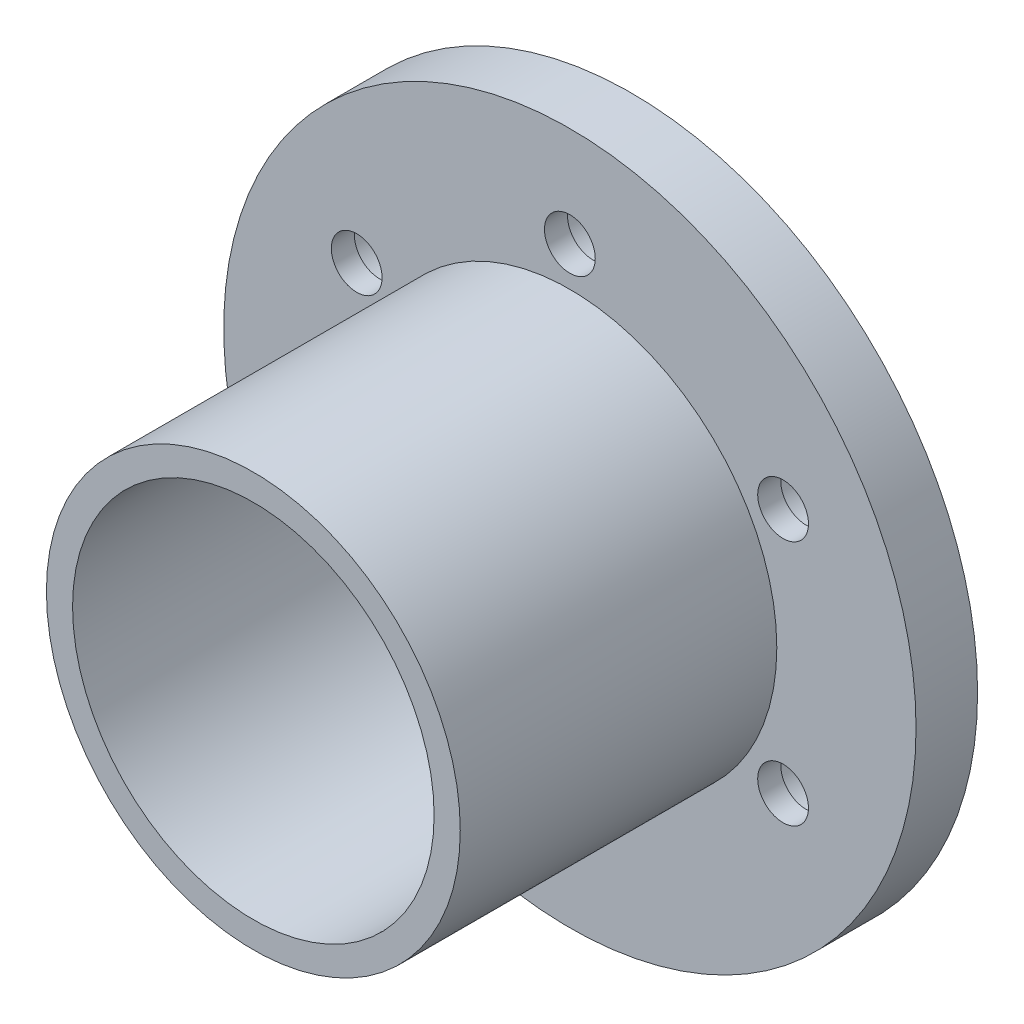
ISO-10303-21;
HEADER;
FILE_DESCRIPTION(('STEP AP214'),'2;1');
FILE_NAME('part.step','',(''),(''),'','','');
FILE_SCHEMA(('AUTOMOTIVE_DESIGN { 1 0 10303 214 1 1 1 1 }'));
ENDSEC;
DATA;
#1=APPLICATION_CONTEXT('core data for automotive mechanical design processes');
#2=APPLICATION_PROTOCOL_DEFINITION('international standard','automotive_design',2000,#1);
#3=PRODUCT_CONTEXT('',#1,'mechanical');
#4=PRODUCT('Part','Part','',(#3));
#5=PRODUCT_RELATED_PRODUCT_CATEGORY('part','',(#4));
#6=PRODUCT_DEFINITION_FORMATION('','',#4);
#7=PRODUCT_DEFINITION_CONTEXT('part definition',#1,'design');
#8=PRODUCT_DEFINITION('design','',#6,#7);
#9=PRODUCT_DEFINITION_SHAPE('','',#8);
#10=(LENGTH_UNIT() NAMED_UNIT(*) SI_UNIT(.MILLI.,.METRE.));
#11=(NAMED_UNIT(*) PLANE_ANGLE_UNIT() SI_UNIT($,.RADIAN.));
#12=(NAMED_UNIT(*) SI_UNIT($,.STERADIAN.) SOLID_ANGLE_UNIT());
#13=UNCERTAINTY_MEASURE_WITH_UNIT(LENGTH_MEASURE(1.E-05),#10,'distance_accuracy_value','');
#14=(GEOMETRIC_REPRESENTATION_CONTEXT(3) GLOBAL_UNCERTAINTY_ASSIGNED_CONTEXT((#13)) GLOBAL_UNIT_ASSIGNED_CONTEXT((#10,
#11,#12)) REPRESENTATION_CONTEXT('',''));
#15=CARTESIAN_POINT('',(0.,0.,0.));
#16=DIRECTION('',(0.,0.,1.));
#17=DIRECTION('',(1.,0.,0.));
#18=AXIS2_PLACEMENT_3D('',#15,#16,#17);
#19=CARTESIAN_POINT('',(0.,0.,8.));
#20=DIRECTION('',(0.,0.,-1.));
#21=DIRECTION('',(-1.,0.,0.));
#22=AXIS2_PLACEMENT_3D('',#19,#20,#21);
#23=CYLINDRICAL_SURFACE('',#22,45.);
#24=CARTESIAN_POINT('',(0.,0.,8.));
#25=DIRECTION('',(0.,0.,1.));
#26=DIRECTION('',(1.,0.,0.));
#27=AXIS2_PLACEMENT_3D('',#24,#25,#26);
#28=CIRCLE('',#27,45.);
#29=CARTESIAN_POINT('',(45.,0.,8.));
#30=VERTEX_POINT('',#29);
#31=EDGE_CURVE('E10',#30,#30,#28,.T.);
#32=ORIENTED_EDGE('',*,*,#31,.F.);
#33=EDGE_LOOP('',(#32));
#34=FACE_BOUND('',#33,.T.);
#35=CARTESIAN_POINT('',(0.,0.,0.));
#36=DIRECTION('',(0.,0.,1.));
#37=DIRECTION('',(1.,0.,0.));
#38=AXIS2_PLACEMENT_3D('',#35,#36,#37);
#39=CIRCLE('',#38,45.);
#40=CARTESIAN_POINT('',(45.,0.,0.));
#41=VERTEX_POINT('',#40);
#42=EDGE_CURVE('E39',#41,#41,#39,.T.);
#43=ORIENTED_EDGE('',*,*,#42,.T.);
#44=EDGE_LOOP('',(#43));
#45=FACE_BOUND('',#44,.T.);
#46=ADVANCED_FACE('F32',(#34,#45),#23,.T.);
#47=CARTESIAN_POINT('',(0.,0.,8.));
#48=DIRECTION('',(0.,0.,1.));
#49=DIRECTION('',(1.,0.,0.));
#50=AXIS2_PLACEMENT_3D('',#47,#48,#49);
#51=PLANE('',#50);
#52=CARTESIAN_POINT('',(27.7128129211019,16.0000000000003,8.));
#53=DIRECTION('',(0.,0.,1.));
#54=DIRECTION('',(1.,0.,0.));
#55=AXIS2_PLACEMENT_3D('',#52,#53,#54);
#56=CIRCLE('',#55,3.3);
#57=CARTESIAN_POINT('',(31.0128129211018,16.0000000000003,8.));
#58=VERTEX_POINT('',#57);
#59=EDGE_CURVE('E35',#58,#58,#56,.T.);
#60=ORIENTED_EDGE('',*,*,#59,.F.);
#61=EDGE_LOOP('',(#60));
#62=FACE_BOUND('',#61,.T.);
#63=CARTESIAN_POINT('',(27.7128129211022,-15.9999999999997,8.));
#64=DIRECTION('',(0.,0.,1.));
#65=DIRECTION('',(1.,0.,0.));
#66=AXIS2_PLACEMENT_3D('',#63,#64,#65);
#67=CIRCLE('',#66,3.3);
#68=CARTESIAN_POINT('',(31.0128129211022,-15.9999999999997,8.));
#69=VERTEX_POINT('',#68);
#70=EDGE_CURVE('E68',#69,#69,#67,.T.);
#71=ORIENTED_EDGE('',*,*,#70,.F.);
#72=EDGE_LOOP('',(#71));
#73=FACE_BOUND('',#72,.T.);
#74=CARTESIAN_POINT('',(0.,-32.,8.));
#75=DIRECTION('',(0.,0.,1.));
#76=DIRECTION('',(1.,0.,0.));
#77=AXIS2_PLACEMENT_3D('',#74,#75,#76);
#78=CIRCLE('',#77,3.3);
#79=CARTESIAN_POINT('',(3.3,-32.,8.));
#80=VERTEX_POINT('',#79);
#81=EDGE_CURVE('E64',#80,#80,#78,.T.);
#82=ORIENTED_EDGE('',*,*,#81,.F.);
#83=EDGE_LOOP('',(#82));
#84=FACE_BOUND('',#83,.T.);
#85=CARTESIAN_POINT('',(-27.712812921102,-16.0000000000001,8.));
#86=DIRECTION('',(0.,0.,1.));
#87=DIRECTION('',(1.,0.,0.));
#88=AXIS2_PLACEMENT_3D('',#85,#86,#87);
#89=CIRCLE('',#88,3.3);
#90=CARTESIAN_POINT('',(-24.412812921102,-16.0000000000001,8.));
#91=VERTEX_POINT('',#90);
#92=EDGE_CURVE('E59',#91,#91,#89,.T.);
#93=ORIENTED_EDGE('',*,*,#92,.F.);
#94=EDGE_LOOP('',(#93));
#95=FACE_BOUND('',#94,.T.);
#96=CARTESIAN_POINT('',(-27.7128129211021,15.9999999999999,8.));
#97=DIRECTION('',(0.,0.,1.));
#98=DIRECTION('',(1.,0.,0.));
#99=AXIS2_PLACEMENT_3D('',#96,#97,#98);
#100=CIRCLE('',#99,3.3);
#101=CARTESIAN_POINT('',(-24.4128129211021,15.9999999999999,8.));
#102=VERTEX_POINT('',#101);
#103=EDGE_CURVE('E54',#102,#102,#100,.T.);
#104=ORIENTED_EDGE('',*,*,#103,.F.);
#105=EDGE_LOOP('',(#104));
#106=FACE_BOUND('',#105,.T.);
#107=CARTESIAN_POINT('',(0.,32.,8.));
#108=DIRECTION('',(0.,0.,1.));
#109=DIRECTION('',(1.,0.,0.));
#110=AXIS2_PLACEMENT_3D('',#107,#108,#109);
#111=CIRCLE('',#110,3.3);
#112=CARTESIAN_POINT('',(3.3,32.,8.));
#113=VERTEX_POINT('',#112);
#114=EDGE_CURVE('E49',#113,#113,#111,.T.);
#115=ORIENTED_EDGE('',*,*,#114,.F.);
#116=EDGE_LOOP('',(#115));
#117=FACE_BOUND('',#116,.T.);
#118=CARTESIAN_POINT('',(0.,0.,8.));
#119=DIRECTION('',(0.,0.,1.));
#120=DIRECTION('',(1.,0.,0.));
#121=AXIS2_PLACEMENT_3D('',#118,#119,#120);
#122=CIRCLE('',#121,26.9);
#123=CARTESIAN_POINT('',(26.9,0.,8.));
#124=VERTEX_POINT('',#123);
#125=EDGE_CURVE('E114',#124,#124,#122,.T.);
#126=ORIENTED_EDGE('',*,*,#125,.F.);
#127=EDGE_LOOP('',(#126));
#128=FACE_BOUND('',#127,.T.);
#129=ORIENTED_EDGE('',*,*,#31,.T.);
#130=EDGE_LOOP('',(#129));
#131=FACE_BOUND('',#130,.T.);
#132=ADVANCED_FACE('F122',(#62,#73,#84,#95,#106,#117,#128,#131),#51,.T.);
#133=CARTESIAN_POINT('',(0.,0.,0.));
#134=DIRECTION('',(0.,0.,1.));
#135=DIRECTION('',(1.,0.,0.));
#136=AXIS2_PLACEMENT_3D('',#133,#134,#135);
#137=PLANE('',#136);
#138=CARTESIAN_POINT('',(27.7128129211019,16.0000000000003,0.));
#139=DIRECTION('',(0.,0.,-1.));
#140=DIRECTION('',(-1.,0.,0.));
#141=AXIS2_PLACEMENT_3D('',#138,#139,#140);
#142=CIRCLE('',#141,5.);
#143=CARTESIAN_POINT('',(22.7128129211018,16.0000000000003,0.));
#144=VERTEX_POINT('',#143);
#145=EDGE_CURVE('E225',#144,#144,#142,.T.);
#146=ORIENTED_EDGE('',*,*,#145,.F.);
#147=EDGE_LOOP('',(#146));
#148=FACE_BOUND('',#147,.T.);
#149=CARTESIAN_POINT('',(27.7128129211022,-15.9999999999997,0.));
#150=DIRECTION('',(0.,0.,-1.));
#151=DIRECTION('',(-1.,0.,0.));
#152=AXIS2_PLACEMENT_3D('',#149,#150,#151);
#153=CIRCLE('',#152,5.);
#154=CARTESIAN_POINT('',(22.7128129211022,-15.9999999999997,0.));
#155=VERTEX_POINT('',#154);
#156=EDGE_CURVE('E83',#155,#155,#153,.T.);
#157=ORIENTED_EDGE('',*,*,#156,.F.);
#158=EDGE_LOOP('',(#157));
#159=FACE_BOUND('',#158,.T.);
#160=CARTESIAN_POINT('',(0.,-32.,0.));
#161=DIRECTION('',(0.,0.,-1.));
#162=DIRECTION('',(-1.,0.,0.));
#163=AXIS2_PLACEMENT_3D('',#160,#161,#162);
#164=CIRCLE('',#163,5.);
#165=CARTESIAN_POINT('',(-5.,-32.,0.));
#166=VERTEX_POINT('',#165);
#167=EDGE_CURVE('E70',#166,#166,#164,.T.);
#168=ORIENTED_EDGE('',*,*,#167,.F.);
#169=EDGE_LOOP('',(#168));
#170=FACE_BOUND('',#169,.T.);
#171=CARTESIAN_POINT('',(-27.712812921102,-16.0000000000001,0.));
#172=DIRECTION('',(0.,0.,-1.));
#173=DIRECTION('',(-1.,0.,0.));
#174=AXIS2_PLACEMENT_3D('',#171,#172,#173);
#175=CIRCLE('',#174,5.);
#176=CARTESIAN_POINT('',(-32.712812921102,-16.0000000000001,0.));
#177=VERTEX_POINT('',#176);
#178=EDGE_CURVE('E66',#177,#177,#175,.T.);
#179=ORIENTED_EDGE('',*,*,#178,.F.);
#180=EDGE_LOOP('',(#179));
#181=FACE_BOUND('',#180,.T.);
#182=CARTESIAN_POINT('',(-27.7128129211021,15.9999999999999,0.));
#183=DIRECTION('',(0.,0.,-1.));
#184=DIRECTION('',(-1.,0.,0.));
#185=AXIS2_PLACEMENT_3D('',#182,#183,#184);
#186=CIRCLE('',#185,5.);
#187=CARTESIAN_POINT('',(-32.7128129211021,15.9999999999999,0.));
#188=VERTEX_POINT('',#187);
#189=EDGE_CURVE('E62',#188,#188,#186,.T.);
#190=ORIENTED_EDGE('',*,*,#189,.F.);
#191=EDGE_LOOP('',(#190));
#192=FACE_BOUND('',#191,.T.);
#193=CARTESIAN_POINT('',(0.,32.,0.));
#194=DIRECTION('',(0.,0.,-1.));
#195=DIRECTION('',(-1.,0.,0.));
#196=AXIS2_PLACEMENT_3D('',#193,#194,#195);
#197=CIRCLE('',#196,5.);
#198=CARTESIAN_POINT('',(-5.,32.,0.));
#199=VERTEX_POINT('',#198);
#200=EDGE_CURVE('E57',#199,#199,#197,.T.);
#201=ORIENTED_EDGE('',*,*,#200,.F.);
#202=EDGE_LOOP('',(#201));
#203=FACE_BOUND('',#202,.T.);
#204=CARTESIAN_POINT('',(0.,0.,0.));
#205=DIRECTION('',(0.,0.,1.));
#206=DIRECTION('',(1.,0.,0.));
#207=AXIS2_PLACEMENT_3D('',#204,#205,#206);
#208=CIRCLE('',#207,23.5);
#209=CARTESIAN_POINT('',(23.5,0.,0.));
#210=VERTEX_POINT('',#209);
#211=EDGE_CURVE('E44',#210,#210,#208,.T.);
#212=ORIENTED_EDGE('',*,*,#211,.T.);
#213=EDGE_LOOP('',(#212));
#214=FACE_BOUND('',#213,.T.);
#215=ORIENTED_EDGE('',*,*,#42,.F.);
#216=EDGE_LOOP('',(#215));
#217=FACE_BOUND('',#216,.T.);
#218=ADVANCED_FACE('F124',(#148,#159,#170,#181,#192,#203,#214,#217),#137,.F.);
#219=CARTESIAN_POINT('',(0.,0.,0.));
#220=DIRECTION('',(0.,0.,1.));
#221=DIRECTION('',(1.,0.,0.));
#222=AXIS2_PLACEMENT_3D('',#219,#220,#221);
#223=CYLINDRICAL_SURFACE('',#222,23.5);
#224=ORIENTED_EDGE('',*,*,#211,.F.);
#225=EDGE_LOOP('',(#224));
#226=FACE_BOUND('',#225,.T.);
#227=CARTESIAN_POINT('',(0.,0.,49.148));
#228=DIRECTION('',(0.,0.,1.));
#229=DIRECTION('',(1.,0.,0.));
#230=AXIS2_PLACEMENT_3D('',#227,#228,#229);
#231=CIRCLE('',#230,23.5);
#232=CARTESIAN_POINT('',(23.5,0.,49.148));
#233=VERTEX_POINT('',#232);
#234=EDGE_CURVE('E52',#233,#233,#231,.T.);
#235=ORIENTED_EDGE('',*,*,#234,.T.);
#236=EDGE_LOOP('',(#235));
#237=FACE_BOUND('',#236,.T.);
#238=ADVANCED_FACE('F131',(#226,#237),#223,.F.);
#239=CARTESIAN_POINT('',(0.,0.,49.148));
#240=DIRECTION('',(0.,0.,-1.));
#241=DIRECTION('',(-1.,0.,0.));
#242=AXIS2_PLACEMENT_3D('',#239,#240,#241);
#243=CYLINDRICAL_SURFACE('',#242,26.9);
#244=CARTESIAN_POINT('',(0.,0.,49.148));
#245=DIRECTION('',(0.,0.,1.));
#246=DIRECTION('',(1.,0.,0.));
#247=AXIS2_PLACEMENT_3D('',#244,#245,#246);
#248=CIRCLE('',#247,26.9);
#249=CARTESIAN_POINT('',(26.9,0.,49.148));
#250=VERTEX_POINT('',#249);
#251=EDGE_CURVE('E115',#250,#250,#248,.T.);
#252=ORIENTED_EDGE('',*,*,#251,.F.);
#253=EDGE_LOOP('',(#252));
#254=FACE_BOUND('',#253,.T.);
#255=ORIENTED_EDGE('',*,*,#125,.T.);
#256=EDGE_LOOP('',(#255));
#257=FACE_BOUND('',#256,.T.);
#258=ADVANCED_FACE('F120',(#254,#257),#243,.T.);
#259=CARTESIAN_POINT('',(0.,0.,49.148));
#260=DIRECTION('',(0.,0.,1.));
#261=DIRECTION('',(1.,0.,0.));
#262=AXIS2_PLACEMENT_3D('',#259,#260,#261);
#263=PLANE('',#262);
#264=ORIENTED_EDGE('',*,*,#234,.F.);
#265=EDGE_LOOP('',(#264));
#266=FACE_BOUND('',#265,.T.);
#267=ORIENTED_EDGE('',*,*,#251,.T.);
#268=EDGE_LOOP('',(#267));
#269=FACE_BOUND('',#268,.T.);
#270=ADVANCED_FACE('F142',(#266,#269),#263,.T.);
#271=CARTESIAN_POINT('',(0.,32.,0.));
#272=DIRECTION('',(0.,0.,-1.));
#273=DIRECTION('',(-1.,0.,0.));
#274=AXIS2_PLACEMENT_3D('',#271,#272,#273);
#275=CYLINDRICAL_SURFACE('',#274,3.3);
#276=ORIENTED_EDGE('',*,*,#114,.T.);
#277=EDGE_LOOP('',(#276));
#278=FACE_BOUND('',#277,.T.);
#279=CARTESIAN_POINT('',(0.,32.,5.));
#280=DIRECTION('',(0.,0.,-1.));
#281=DIRECTION('',(-1.,0.,0.));
#282=AXIS2_PLACEMENT_3D('',#279,#280,#281);
#283=CIRCLE('',#282,3.3);
#284=CARTESIAN_POINT('',(-3.3,32.,5.));
#285=VERTEX_POINT('',#284);
#286=EDGE_CURVE('E53',#285,#285,#283,.T.);
#287=ORIENTED_EDGE('',*,*,#286,.T.);
#288=EDGE_LOOP('',(#287));
#289=FACE_BOUND('',#288,.T.);
#290=ADVANCED_FACE('F146',(#278,#289),#275,.F.);
#291=CARTESIAN_POINT('',(3.3,32.,5.));
#292=DIRECTION('',(0.,0.,1.));
#293=DIRECTION('',(1.,0.,0.));
#294=AXIS2_PLACEMENT_3D('',#291,#292,#293);
#295=PLANE('',#294);
#296=ORIENTED_EDGE('',*,*,#286,.F.);
#297=EDGE_LOOP('',(#296));
#298=FACE_BOUND('',#297,.T.);
#299=CARTESIAN_POINT('',(0.,32.,5.));
#300=DIRECTION('',(0.,0.,-1.));
#301=DIRECTION('',(-1.,0.,0.));
#302=AXIS2_PLACEMENT_3D('',#299,#300,#301);
#303=CIRCLE('',#302,5.);
#304=CARTESIAN_POINT('',(-5.,32.,5.));
#305=VERTEX_POINT('',#304);
#306=EDGE_CURVE('E107',#305,#305,#303,.T.);
#307=ORIENTED_EDGE('',*,*,#306,.T.);
#308=EDGE_LOOP('',(#307));
#309=FACE_BOUND('',#308,.T.);
#310=ADVANCED_FACE('F150',(#298,#309),#295,.F.);
#311=CARTESIAN_POINT('',(0.,32.,0.));
#312=DIRECTION('',(0.,0.,-1.));
#313=DIRECTION('',(-1.,0.,0.));
#314=AXIS2_PLACEMENT_3D('',#311,#312,#313);
#315=CYLINDRICAL_SURFACE('',#314,5.);
#316=ORIENTED_EDGE('',*,*,#306,.F.);
#317=EDGE_LOOP('',(#316));
#318=FACE_BOUND('',#317,.T.);
#319=ORIENTED_EDGE('',*,*,#200,.T.);
#320=EDGE_LOOP('',(#319));
#321=FACE_BOUND('',#320,.T.);
#322=ADVANCED_FACE('F154',(#318,#321),#315,.F.);
#323=CARTESIAN_POINT('',(-27.7128129211021,15.9999999999999,0.));
#324=DIRECTION('',(0.,0.,-1.));
#325=DIRECTION('',(-1.,0.,0.));
#326=AXIS2_PLACEMENT_3D('',#323,#324,#325);
#327=CYLINDRICAL_SURFACE('',#326,3.3);
#328=ORIENTED_EDGE('',*,*,#103,.T.);
#329=EDGE_LOOP('',(#328));
#330=FACE_BOUND('',#329,.T.);
#331=CARTESIAN_POINT('',(-27.7128129211021,15.9999999999999,5.));
#332=DIRECTION('',(0.,0.,-1.));
#333=DIRECTION('',(-1.,0.,0.));
#334=AXIS2_PLACEMENT_3D('',#331,#332,#333);
#335=CIRCLE('',#334,3.3);
#336=CARTESIAN_POINT('',(-31.0128129211021,15.9999999999999,5.));
#337=VERTEX_POINT('',#336);
#338=EDGE_CURVE('E58',#337,#337,#335,.T.);
#339=ORIENTED_EDGE('',*,*,#338,.T.);
#340=EDGE_LOOP('',(#339));
#341=FACE_BOUND('',#340,.T.);
#342=ADVANCED_FACE('F158',(#330,#341),#327,.F.);
#343=CARTESIAN_POINT('',(-24.4128129211021,15.9999999999999,5.));
#344=DIRECTION('',(0.,0.,1.));
#345=DIRECTION('',(1.,0.,0.));
#346=AXIS2_PLACEMENT_3D('',#343,#344,#345);
#347=PLANE('',#346);
#348=ORIENTED_EDGE('',*,*,#338,.F.);
#349=EDGE_LOOP('',(#348));
#350=FACE_BOUND('',#349,.T.);
#351=CARTESIAN_POINT('',(-27.7128129211021,15.9999999999999,5.));
#352=DIRECTION('',(0.,0.,-1.));
#353=DIRECTION('',(-1.,0.,0.));
#354=AXIS2_PLACEMENT_3D('',#351,#352,#353);
#355=CIRCLE('',#354,5.);
#356=CARTESIAN_POINT('',(-32.7128129211021,15.9999999999999,5.));
#357=VERTEX_POINT('',#356);
#358=EDGE_CURVE('E100',#357,#357,#355,.T.);
#359=ORIENTED_EDGE('',*,*,#358,.T.);
#360=EDGE_LOOP('',(#359));
#361=FACE_BOUND('',#360,.T.);
#362=ADVANCED_FACE('F162',(#350,#361),#347,.F.);
#363=CARTESIAN_POINT('',(-27.7128129211021,15.9999999999999,0.));
#364=DIRECTION('',(0.,0.,-1.));
#365=DIRECTION('',(-1.,0.,0.));
#366=AXIS2_PLACEMENT_3D('',#363,#364,#365);
#367=CYLINDRICAL_SURFACE('',#366,5.);
#368=ORIENTED_EDGE('',*,*,#358,.F.);
#369=EDGE_LOOP('',(#368));
#370=FACE_BOUND('',#369,.T.);
#371=ORIENTED_EDGE('',*,*,#189,.T.);
#372=EDGE_LOOP('',(#371));
#373=FACE_BOUND('',#372,.T.);
#374=ADVANCED_FACE('F166',(#370,#373),#367,.F.);
#375=CARTESIAN_POINT('',(-27.712812921102,-16.0000000000001,0.));
#376=DIRECTION('',(0.,0.,-1.));
#377=DIRECTION('',(-1.,0.,0.));
#378=AXIS2_PLACEMENT_3D('',#375,#376,#377);
#379=CYLINDRICAL_SURFACE('',#378,3.3);
#380=ORIENTED_EDGE('',*,*,#92,.T.);
#381=EDGE_LOOP('',(#380));
#382=FACE_BOUND('',#381,.T.);
#383=CARTESIAN_POINT('',(-27.712812921102,-16.0000000000001,5.));
#384=DIRECTION('',(0.,0.,-1.));
#385=DIRECTION('',(-1.,0.,0.));
#386=AXIS2_PLACEMENT_3D('',#383,#384,#385);
#387=CIRCLE('',#386,3.3);
#388=CARTESIAN_POINT('',(-31.012812921102,-16.0000000000001,5.));
#389=VERTEX_POINT('',#388);
#390=EDGE_CURVE('E63',#389,#389,#387,.T.);
#391=ORIENTED_EDGE('',*,*,#390,.T.);
#392=EDGE_LOOP('',(#391));
#393=FACE_BOUND('',#392,.T.);
#394=ADVANCED_FACE('F170',(#382,#393),#379,.F.);
#395=CARTESIAN_POINT('',(-24.412812921102,-16.0000000000001,5.));
#396=DIRECTION('',(0.,0.,1.));
#397=DIRECTION('',(1.,0.,0.));
#398=AXIS2_PLACEMENT_3D('',#395,#396,#397);
#399=PLANE('',#398);
#400=ORIENTED_EDGE('',*,*,#390,.F.);
#401=EDGE_LOOP('',(#400));
#402=FACE_BOUND('',#401,.T.);
#403=CARTESIAN_POINT('',(-27.712812921102,-16.0000000000001,5.));
#404=DIRECTION('',(0.,0.,-1.));
#405=DIRECTION('',(-1.,0.,0.));
#406=AXIS2_PLACEMENT_3D('',#403,#404,#405);
#407=CIRCLE('',#406,5.);
#408=CARTESIAN_POINT('',(-32.712812921102,-16.0000000000001,5.));
#409=VERTEX_POINT('',#408);
#410=EDGE_CURVE('E93',#409,#409,#407,.T.);
#411=ORIENTED_EDGE('',*,*,#410,.T.);
#412=EDGE_LOOP('',(#411));
#413=FACE_BOUND('',#412,.T.);
#414=ADVANCED_FACE('F174',(#402,#413),#399,.F.);
#415=CARTESIAN_POINT('',(-27.712812921102,-16.0000000000001,0.));
#416=DIRECTION('',(0.,0.,-1.));
#417=DIRECTION('',(-1.,0.,0.));
#418=AXIS2_PLACEMENT_3D('',#415,#416,#417);
#419=CYLINDRICAL_SURFACE('',#418,5.);
#420=ORIENTED_EDGE('',*,*,#410,.F.);
#421=EDGE_LOOP('',(#420));
#422=FACE_BOUND('',#421,.T.);
#423=ORIENTED_EDGE('',*,*,#178,.T.);
#424=EDGE_LOOP('',(#423));
#425=FACE_BOUND('',#424,.T.);
#426=ADVANCED_FACE('F178',(#422,#425),#419,.F.);
#427=CARTESIAN_POINT('',(0.,-32.,0.));
#428=DIRECTION('',(0.,0.,-1.));
#429=DIRECTION('',(-1.,0.,0.));
#430=AXIS2_PLACEMENT_3D('',#427,#428,#429);
#431=CYLINDRICAL_SURFACE('',#430,3.3);
#432=ORIENTED_EDGE('',*,*,#81,.T.);
#433=EDGE_LOOP('',(#432));
#434=FACE_BOUND('',#433,.T.);
#435=CARTESIAN_POINT('',(0.,-32.,5.));
#436=DIRECTION('',(0.,0.,-1.));
#437=DIRECTION('',(-1.,0.,0.));
#438=AXIS2_PLACEMENT_3D('',#435,#436,#437);
#439=CIRCLE('',#438,3.3);
#440=CARTESIAN_POINT('',(-3.3,-32.,5.));
#441=VERTEX_POINT('',#440);
#442=EDGE_CURVE('E67',#441,#441,#439,.T.);
#443=ORIENTED_EDGE('',*,*,#442,.T.);
#444=EDGE_LOOP('',(#443));
#445=FACE_BOUND('',#444,.T.);
#446=ADVANCED_FACE('F182',(#434,#445),#431,.F.);
#447=CARTESIAN_POINT('',(3.3,-32.,5.));
#448=DIRECTION('',(0.,0.,1.));
#449=DIRECTION('',(1.,0.,0.));
#450=AXIS2_PLACEMENT_3D('',#447,#448,#449);
#451=PLANE('',#450);
#452=ORIENTED_EDGE('',*,*,#442,.F.);
#453=EDGE_LOOP('',(#452));
#454=FACE_BOUND('',#453,.T.);
#455=CARTESIAN_POINT('',(0.,-32.,5.));
#456=DIRECTION('',(0.,0.,-1.));
#457=DIRECTION('',(-1.,0.,0.));
#458=AXIS2_PLACEMENT_3D('',#455,#456,#457);
#459=CIRCLE('',#458,5.);
#460=CARTESIAN_POINT('',(-5.,-32.,5.));
#461=VERTEX_POINT('',#460);
#462=EDGE_CURVE('E75',#461,#461,#459,.T.);
#463=ORIENTED_EDGE('',*,*,#462,.T.);
#464=EDGE_LOOP('',(#463));
#465=FACE_BOUND('',#464,.T.);
#466=ADVANCED_FACE('F186',(#454,#465),#451,.F.);
#467=CARTESIAN_POINT('',(0.,-32.,0.));
#468=DIRECTION('',(0.,0.,-1.));
#469=DIRECTION('',(-1.,0.,0.));
#470=AXIS2_PLACEMENT_3D('',#467,#468,#469);
#471=CYLINDRICAL_SURFACE('',#470,5.);
#472=ORIENTED_EDGE('',*,*,#462,.F.);
#473=EDGE_LOOP('',(#472));
#474=FACE_BOUND('',#473,.T.);
#475=ORIENTED_EDGE('',*,*,#167,.T.);
#476=EDGE_LOOP('',(#475));
#477=FACE_BOUND('',#476,.T.);
#478=ADVANCED_FACE('F190',(#474,#477),#471,.F.);
#479=CARTESIAN_POINT('',(27.7128129211022,-15.9999999999997,0.));
#480=DIRECTION('',(0.,0.,-1.));
#481=DIRECTION('',(-1.,0.,0.));
#482=AXIS2_PLACEMENT_3D('',#479,#480,#481);
#483=CYLINDRICAL_SURFACE('',#482,3.3);
#484=ORIENTED_EDGE('',*,*,#70,.T.);
#485=EDGE_LOOP('',(#484));
#486=FACE_BOUND('',#485,.T.);
#487=CARTESIAN_POINT('',(27.7128129211022,-15.9999999999997,5.));
#488=DIRECTION('',(0.,0.,-1.));
#489=DIRECTION('',(-1.,0.,0.));
#490=AXIS2_PLACEMENT_3D('',#487,#488,#489);
#491=CIRCLE('',#490,3.3);
#492=CARTESIAN_POINT('',(24.4128129211022,-15.9999999999997,5.));
#493=VERTEX_POINT('',#492);
#494=EDGE_CURVE('E71',#493,#493,#491,.T.);
#495=ORIENTED_EDGE('',*,*,#494,.T.);
#496=EDGE_LOOP('',(#495));
#497=FACE_BOUND('',#496,.T.);
#498=ADVANCED_FACE('F194',(#486,#497),#483,.F.);
#499=CARTESIAN_POINT('',(31.0128129211022,-15.9999999999997,5.));
#500=DIRECTION('',(0.,0.,1.));
#501=DIRECTION('',(1.,0.,0.));
#502=AXIS2_PLACEMENT_3D('',#499,#500,#501);
#503=PLANE('',#502);
#504=ORIENTED_EDGE('',*,*,#494,.F.);
#505=EDGE_LOOP('',(#504));
#506=FACE_BOUND('',#505,.T.);
#507=CARTESIAN_POINT('',(27.7128129211022,-15.9999999999997,5.));
#508=DIRECTION('',(0.,0.,-1.));
#509=DIRECTION('',(-1.,0.,0.));
#510=AXIS2_PLACEMENT_3D('',#507,#508,#509);
#511=CIRCLE('',#510,5.);
#512=CARTESIAN_POINT('',(22.7128129211022,-15.9999999999997,5.));
#513=VERTEX_POINT('',#512);
#514=EDGE_CURVE('E78',#513,#513,#511,.T.);
#515=ORIENTED_EDGE('',*,*,#514,.T.);
#516=EDGE_LOOP('',(#515));
#517=FACE_BOUND('',#516,.T.);
#518=ADVANCED_FACE('F198',(#506,#517),#503,.F.);
#519=CARTESIAN_POINT('',(27.7128129211022,-15.9999999999997,0.));
#520=DIRECTION('',(0.,0.,-1.));
#521=DIRECTION('',(-1.,0.,0.));
#522=AXIS2_PLACEMENT_3D('',#519,#520,#521);
#523=CYLINDRICAL_SURFACE('',#522,5.);
#524=ORIENTED_EDGE('',*,*,#514,.F.);
#525=EDGE_LOOP('',(#524));
#526=FACE_BOUND('',#525,.T.);
#527=ORIENTED_EDGE('',*,*,#156,.T.);
#528=EDGE_LOOP('',(#527));
#529=FACE_BOUND('',#528,.T.);
#530=ADVANCED_FACE('F201',(#526,#529),#523,.F.);
#531=CARTESIAN_POINT('',(27.7128129211019,16.0000000000003,0.));
#532=DIRECTION('',(0.,0.,-1.));
#533=DIRECTION('',(-1.,0.,0.));
#534=AXIS2_PLACEMENT_3D('',#531,#532,#533);
#535=CYLINDRICAL_SURFACE('',#534,3.3);
#536=ORIENTED_EDGE('',*,*,#59,.T.);
#537=EDGE_LOOP('',(#536));
#538=FACE_BOUND('',#537,.T.);
#539=CARTESIAN_POINT('',(27.7128129211019,16.0000000000003,5.));
#540=DIRECTION('',(0.,0.,-1.));
#541=DIRECTION('',(-1.,0.,0.));
#542=AXIS2_PLACEMENT_3D('',#539,#540,#541);
#543=CIRCLE('',#542,3.3);
#544=CARTESIAN_POINT('',(24.4128129211018,16.0000000000003,5.));
#545=VERTEX_POINT('',#544);
#546=EDGE_CURVE('E227',#545,#545,#543,.T.);
#547=ORIENTED_EDGE('',*,*,#546,.T.);
#548=EDGE_LOOP('',(#547));
#549=FACE_BOUND('',#548,.T.);
#550=ADVANCED_FACE('F205',(#538,#549),#535,.F.);
#551=CARTESIAN_POINT('',(31.0128129211019,16.0000000000003,5.));
#552=DIRECTION('',(0.,0.,1.));
#553=DIRECTION('',(1.,0.,0.));
#554=AXIS2_PLACEMENT_3D('',#551,#552,#553);
#555=PLANE('',#554);
#556=ORIENTED_EDGE('',*,*,#546,.F.);
#557=EDGE_LOOP('',(#556));
#558=FACE_BOUND('',#557,.T.);
#559=CARTESIAN_POINT('',(27.7128129211019,16.0000000000003,5.));
#560=DIRECTION('',(0.,0.,-1.));
#561=DIRECTION('',(-1.,0.,0.));
#562=AXIS2_PLACEMENT_3D('',#559,#560,#561);
#563=CIRCLE('',#562,5.);
#564=CARTESIAN_POINT('',(22.7128129211019,16.0000000000003,5.));
#565=VERTEX_POINT('',#564);
#566=EDGE_CURVE('E222',#565,#565,#563,.T.);
#567=ORIENTED_EDGE('',*,*,#566,.T.);
#568=EDGE_LOOP('',(#567));
#569=FACE_BOUND('',#568,.T.);
#570=ADVANCED_FACE('F209',(#558,#569),#555,.F.);
#571=CARTESIAN_POINT('',(27.7128129211019,16.0000000000003,0.));
#572=DIRECTION('',(0.,0.,-1.));
#573=DIRECTION('',(-1.,0.,0.));
#574=AXIS2_PLACEMENT_3D('',#571,#572,#573);
#575=CYLINDRICAL_SURFACE('',#574,5.);
#576=ORIENTED_EDGE('',*,*,#566,.F.);
#577=EDGE_LOOP('',(#576));
#578=FACE_BOUND('',#577,.T.);
#579=ORIENTED_EDGE('',*,*,#145,.T.);
#580=EDGE_LOOP('',(#579));
#581=FACE_BOUND('',#580,.T.);
#582=ADVANCED_FACE('F213',(#578,#581),#575,.F.);
#583=CLOSED_SHELL('',(#46,#132,#218,#238,#258,#270,#290,#310,#322,#342,#362,#374,#394,#414,#426,
#446,#466,#478,#498,#518,#530,#550,#570,#582));
#584=MANIFOLD_SOLID_BREP('B2',#583);
#585=ADVANCED_BREP_SHAPE_REPRESENTATION('',(#18,#584),#14);
#586=SHAPE_DEFINITION_REPRESENTATION(#9,#585);
ENDSEC;
END-ISO-10303-21;
